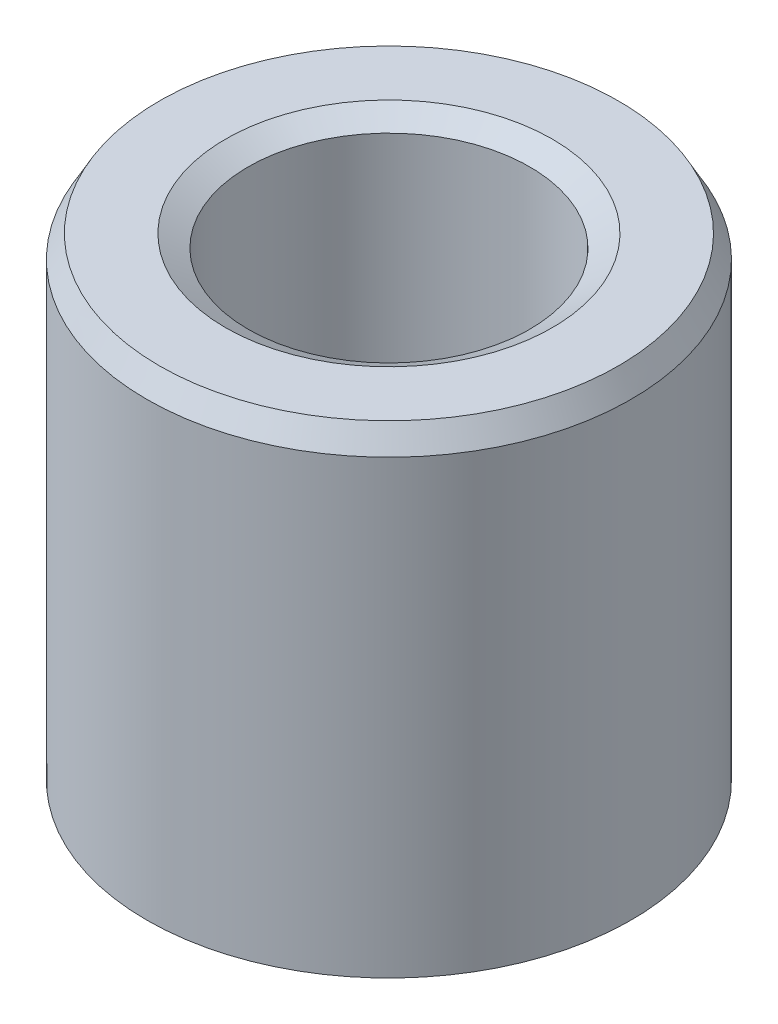
ISO-10303-21;
HEADER;
FILE_DESCRIPTION(('STEP AP214'),'2;1');
FILE_NAME('part.step','',(''),(''),'','','');
FILE_SCHEMA(('AUTOMOTIVE_DESIGN { 1 0 10303 214 1 1 1 1 }'));
ENDSEC;
DATA;
#1=APPLICATION_CONTEXT('core data for automotive mechanical design processes');
#2=APPLICATION_PROTOCOL_DEFINITION('international standard','automotive_design',2000,#1);
#3=PRODUCT_CONTEXT('',#1,'mechanical');
#4=PRODUCT('Part','Part','',(#3));
#5=PRODUCT_RELATED_PRODUCT_CATEGORY('part','',(#4));
#6=PRODUCT_DEFINITION_FORMATION('','',#4);
#7=PRODUCT_DEFINITION_CONTEXT('part definition',#1,'design');
#8=PRODUCT_DEFINITION('design','',#6,#7);
#9=PRODUCT_DEFINITION_SHAPE('','',#8);
#10=(LENGTH_UNIT() NAMED_UNIT(*) SI_UNIT(.MILLI.,.METRE.));
#11=(NAMED_UNIT(*) PLANE_ANGLE_UNIT() SI_UNIT($,.RADIAN.));
#12=(NAMED_UNIT(*) SI_UNIT($,.STERADIAN.) SOLID_ANGLE_UNIT());
#13=UNCERTAINTY_MEASURE_WITH_UNIT(LENGTH_MEASURE(1.E-05),#10,'distance_accuracy_value','');
#14=(GEOMETRIC_REPRESENTATION_CONTEXT(3) GLOBAL_UNCERTAINTY_ASSIGNED_CONTEXT((#13)) GLOBAL_UNIT_ASSIGNED_CONTEXT((#10,
#11,#12)) REPRESENTATION_CONTEXT('',''));
#15=CARTESIAN_POINT('',(0.,0.,0.));
#16=DIRECTION('',(0.,0.,1.));
#17=DIRECTION('',(1.,0.,0.));
#18=AXIS2_PLACEMENT_3D('',#15,#16,#17);
#19=CARTESIAN_POINT('',(0.,60.2380015320802,0.));
#20=DIRECTION('',(0.,-1.,0.));
#21=DIRECTION('',(0.,0.,-1.));
#22=AXIS2_PLACEMENT_3D('',#19,#20,#21);
#23=CYLINDRICAL_SURFACE('',#22,30.);
#24=CARTESIAN_POINT('',(0.,1.57377322664465,0.));
#25=DIRECTION('',(0.,1.,0.));
#26=DIRECTION('',(0.,0.,1.));
#27=AXIS2_PLACEMENT_3D('',#24,#25,#26);
#28=CIRCLE('',#27,30.);
#29=CARTESIAN_POINT('',(0.,1.57377322664465,30.));
#30=VERTEX_POINT('',#29);
#31=EDGE_CURVE('E10',#30,#30,#28,.T.);
#32=ORIENTED_EDGE('',*,*,#31,.T.);
#33=EDGE_LOOP('',(#32));
#34=FACE_BOUND('',#33,.T.);
#35=CARTESIAN_POINT('',(0.,57.4370183520787,0.));
#36=DIRECTION('',(0.,1.,0.));
#37=DIRECTION('',(0.,0.,1.));
#38=AXIS2_PLACEMENT_3D('',#35,#36,#37);
#39=CIRCLE('',#38,30.);
#40=CARTESIAN_POINT('',(0.,57.4370183520787,30.));
#41=VERTEX_POINT('',#40);
#42=EDGE_CURVE('E50',#41,#41,#39,.F.);
#43=ORIENTED_EDGE('',*,*,#42,.T.);
#44=EDGE_LOOP('',(#43));
#45=FACE_BOUND('',#44,.T.);
#46=ADVANCED_FACE('F39',(#34,#45),#23,.T.);
#47=CARTESIAN_POINT('',(0.,60.2380015320802,0.));
#48=DIRECTION('',(0.,1.,0.));
#49=DIRECTION('',(0.,0.,1.));
#50=AXIS2_PLACEMENT_3D('',#47,#48,#49);
#51=PLANE('',#50);
#52=CARTESIAN_POINT('',(0.,60.2380015320802,0.));
#53=DIRECTION('',(0.,1.,0.));
#54=DIRECTION('',(0.,0.,1.));
#55=AXIS2_PLACEMENT_3D('',#52,#53,#54);
#56=CIRCLE('',#55,20.2364594840862);
#57=CARTESIAN_POINT('',(0.,60.2380015320802,20.2364594840862));
#58=VERTEX_POINT('',#57);
#59=EDGE_CURVE('E58',#58,#58,#56,.F.);
#60=ORIENTED_EDGE('',*,*,#59,.T.);
#61=EDGE_LOOP('',(#60));
#62=FACE_BOUND('',#61,.T.);
#63=CARTESIAN_POINT('',(0.,60.2380015320802,0.));
#64=DIRECTION('',(0.,1.,0.));
#65=DIRECTION('',(0.,0.,1.));
#66=AXIS2_PLACEMENT_3D('',#63,#64,#65);
#67=CIRCLE('',#66,28.4262267733553);
#68=CARTESIAN_POINT('',(0.,60.2380015320802,28.4262267733553));
#69=VERTEX_POINT('',#68);
#70=EDGE_CURVE('E61',#69,#69,#67,.T.);
#71=ORIENTED_EDGE('',*,*,#70,.T.);
#72=EDGE_LOOP('',(#71));
#73=FACE_BOUND('',#72,.T.);
#74=ADVANCED_FACE('F88',(#62,#73),#51,.T.);
#75=CARTESIAN_POINT('',(0.,0.,0.));
#76=DIRECTION('',(0.,1.,0.));
#77=DIRECTION('',(0.,0.,1.));
#78=AXIS2_PLACEMENT_3D('',#75,#76,#77);
#79=PLANE('',#78);
#80=CARTESIAN_POINT('',(0.,0.,0.));
#81=DIRECTION('',(0.,1.,0.));
#82=DIRECTION('',(0.,0.,1.));
#83=AXIS2_PLACEMENT_3D('',#80,#81,#82);
#84=CIRCLE('',#83,19.0092495307294);
#85=CARTESIAN_POINT('',(0.,0.,19.0092495307294));
#86=VERTEX_POINT('',#85);
#87=EDGE_CURVE('E51',#86,#86,#84,.T.);
#88=ORIENTED_EDGE('',*,*,#87,.T.);
#89=EDGE_LOOP('',(#88));
#90=FACE_BOUND('',#89,.T.);
#91=CARTESIAN_POINT('',(0.,0.,0.));
#92=DIRECTION('',(0.,1.,0.));
#93=DIRECTION('',(0.,0.,1.));
#94=AXIS2_PLACEMENT_3D('',#91,#92,#93);
#95=CIRCLE('',#94,27.1990168199985);
#96=CARTESIAN_POINT('',(0.,0.,27.1990168199985));
#97=VERTEX_POINT('',#96);
#98=EDGE_CURVE('E54',#97,#97,#95,.F.);
#99=ORIENTED_EDGE('',*,*,#98,.T.);
#100=EDGE_LOOP('',(#99));
#101=FACE_BOUND('',#100,.T.);
#102=ADVANCED_FACE('F83',(#90,#101),#79,.F.);
#103=CARTESIAN_POINT('',(0.,60.2380015320802,0.));
#104=DIRECTION('',(0.,-1.,0.));
#105=DIRECTION('',(0.,0.,-1.));
#106=AXIS2_PLACEMENT_3D('',#103,#104,#105);
#107=CYLINDRICAL_SURFACE('',#106,17.4354763040847);
#108=CARTESIAN_POINT('',(0.,58.6642283054355,0.));
#109=DIRECTION('',(0.,1.,0.));
#110=DIRECTION('',(0.,0.,1.));
#111=AXIS2_PLACEMENT_3D('',#108,#109,#110);
#112=CIRCLE('',#111,17.4354763040847);
#113=CARTESIAN_POINT('',(0.,58.6642283054355,17.4354763040847));
#114=VERTEX_POINT('',#113);
#115=EDGE_CURVE('E67',#114,#114,#112,.T.);
#116=ORIENTED_EDGE('',*,*,#115,.T.);
#117=EDGE_LOOP('',(#116));
#118=FACE_BOUND('',#117,.T.);
#119=CARTESIAN_POINT('',(0.,2.80098318000147,0.));
#120=DIRECTION('',(0.,1.,0.));
#121=DIRECTION('',(0.,0.,1.));
#122=AXIS2_PLACEMENT_3D('',#119,#120,#121);
#123=CIRCLE('',#122,17.4354763040847);
#124=CARTESIAN_POINT('',(0.,2.80098318000147,17.4354763040847));
#125=VERTEX_POINT('',#124);
#126=EDGE_CURVE('E69',#125,#125,#123,.F.);
#127=ORIENTED_EDGE('',*,*,#126,.T.);
#128=EDGE_LOOP('',(#127));
#129=FACE_BOUND('',#128,.T.);
#130=ADVANCED_FACE('F71',(#118,#129),#107,.F.);
#131=CARTESIAN_POINT('',(0.,58.6642283054355,0.));
#132=DIRECTION('',(0.,1.,0.));
#133=DIRECTION('',(0.,0.,1.));
#134=AXIS2_PLACEMENT_3D('',#131,#132,#133);
#135=CONICAL_SURFACE('',#134,17.4354763040847,1.05888969356454);
#136=ORIENTED_EDGE('',*,*,#59,.F.);
#137=EDGE_LOOP('',(#136));
#138=FACE_BOUND('',#137,.T.);
#139=ORIENTED_EDGE('',*,*,#115,.F.);
#140=EDGE_LOOP('',(#139));
#141=FACE_BOUND('',#140,.T.);
#142=ADVANCED_FACE('F77',(#138,#141),#135,.F.);
#143=CARTESIAN_POINT('',(0.,0.,0.));
#144=DIRECTION('',(0.,-1.,0.));
#145=DIRECTION('',(0.,0.,-1.));
#146=AXIS2_PLACEMENT_3D('',#143,#144,#145);
#147=CONICAL_SURFACE('',#146,19.0092495307294,0.511906633230354);
#148=ORIENTED_EDGE('',*,*,#126,.F.);
#149=EDGE_LOOP('',(#148));
#150=FACE_BOUND('',#149,.T.);
#151=ORIENTED_EDGE('',*,*,#87,.F.);
#152=EDGE_LOOP('',(#151));
#153=FACE_BOUND('',#152,.T.);
#154=ADVANCED_FACE('F73',(#150,#153),#147,.F.);
#155=CARTESIAN_POINT('',(0.,1.57377322664465,0.));
#156=DIRECTION('',(0.,1.,0.));
#157=DIRECTION('',(0.,0.,1.));
#158=AXIS2_PLACEMENT_3D('',#155,#156,#157);
#159=CONICAL_SURFACE('',#158,30.,1.05888969356454);
#160=CARTESIAN_POINT('',(0.,0.,27.1990168199985));
#161=CARTESIAN_POINT('',(0.,0.0163934711108812,27.2281937281235));
#162=CARTESIAN_POINT('',(0.,0.0327869422217631,27.2573706362486));
#163=CARTESIAN_POINT('',(0.,0.065573884443527,27.3157244524986));
#164=CARTESIAN_POINT('',(0.,0.0819673555544089,27.3449013606236));
#165=CARTESIAN_POINT('',(0.,0.114754297776172,27.4032551768736));
#166=CARTESIAN_POINT('',(0.,0.131147768887054,27.4324320849987));
#167=CARTESIAN_POINT('',(0.,0.163934711108817,27.4907859012487));
#168=CARTESIAN_POINT('',(0.,0.180328182219699,27.5199628093737));
#169=CARTESIAN_POINT('',(0.,0.213115124441463,27.5783166256237));
#170=CARTESIAN_POINT('',(0.,0.229508595552344,27.6074935337487));
#171=CARTESIAN_POINT('',(0.,0.262295537774108,27.6658473499988));
#172=CARTESIAN_POINT('',(0.,0.27868900888499,27.6950242581238));
#173=CARTESIAN_POINT('',(0.,0.311475951106753,27.7533780743738));
#174=CARTESIAN_POINT('',(0.,0.327869422217635,27.7825549824988));
#175=CARTESIAN_POINT('',(0.,0.360656364439398,27.8409087987489));
#176=CARTESIAN_POINT('',(0.,0.37704983555028,27.8700857068739));
#177=CARTESIAN_POINT('',(0.,0.409836777772044,27.9284395231239));
#178=CARTESIAN_POINT('',(0.,0.426230248882926,27.9576164312489));
#179=CARTESIAN_POINT('',(0.,0.459017191104689,28.015970247499));
#180=CARTESIAN_POINT('',(0.,0.47541066221557,28.045147155624));
#181=CARTESIAN_POINT('',(0.,0.508197604437334,28.103500971874));
#182=CARTESIAN_POINT('',(0.,0.524591075548216,28.132677879999));
#183=CARTESIAN_POINT('',(0.,0.55737801776998,28.191031696249));
#184=CARTESIAN_POINT('',(0.,0.573771488880861,28.2202086043741));
#185=CARTESIAN_POINT('',(0.,0.606558431102625,28.2785624206241));
#186=CARTESIAN_POINT('',(0.,0.622951902213506,28.3077393287491));
#187=CARTESIAN_POINT('',(0.,0.65573884443527,28.3660931449991));
#188=CARTESIAN_POINT('',(0.,0.672132315546151,28.3952700531242));
#189=CARTESIAN_POINT('',(0.,0.704919257767915,28.4536238693742));
#190=CARTESIAN_POINT('',(0.,0.721312728878797,28.4828007774992));
#191=CARTESIAN_POINT('',(0.,0.75409967110056,28.5411545937492));
#192=CARTESIAN_POINT('',(0.,0.770493142211442,28.5703315018742));
#193=CARTESIAN_POINT('',(0.,0.803280084433206,28.6286853181243));
#194=CARTESIAN_POINT('',(0.,0.819673555544087,28.6578622262493));
#195=CARTESIAN_POINT('',(0.,0.852460497765851,28.7162160424993));
#196=CARTESIAN_POINT('',(0.,0.868853968876732,28.7453929506243));
#197=CARTESIAN_POINT('',(0.,0.901640911098496,28.8037467668744));
#198=CARTESIAN_POINT('',(0.,0.918034382209378,28.8329236749994));
#199=CARTESIAN_POINT('',(0.,0.950821324431141,28.8912774912494));
#200=CARTESIAN_POINT('',(0.,0.967214795542023,28.9204543993744));
#201=CARTESIAN_POINT('',(0.,1.00000173776379,28.9788082156245));
#202=CARTESIAN_POINT('',(0.,1.01639520887467,29.0079851237495));
#203=CARTESIAN_POINT('',(0.,1.04918215109643,29.0663389399995));
#204=CARTESIAN_POINT('',(0.,1.06557562220731,29.0955158481245));
#205=CARTESIAN_POINT('',(0.,1.09836256442908,29.1538696643746));
#206=CARTESIAN_POINT('',(0.,1.11475603553996,29.1830465724996));
#207=CARTESIAN_POINT('',(0.,1.14754297776172,29.2414003887496));
#208=CARTESIAN_POINT('',(0.,1.1639364488726,29.2705772968746));
#209=CARTESIAN_POINT('',(0.,1.19672339109437,29.3289311131246));
#210=CARTESIAN_POINT('',(0.,1.21311686220525,29.3581080212497));
#211=CARTESIAN_POINT('',(0.,1.24590380442701,29.4164618374997));
#212=CARTESIAN_POINT('',(0.,1.26229727553789,29.4456387456247));
#213=CARTESIAN_POINT('',(0.,1.29508421775966,29.5039925618747));
#214=CARTESIAN_POINT('',(0.,1.31147768887054,29.5331694699998));
#215=CARTESIAN_POINT('',(0.,1.3442646310923,29.5915232862498));
#216=CARTESIAN_POINT('',(0.,1.36065810220318,29.6207001943748));
#217=CARTESIAN_POINT('',(0.,1.39344504442495,29.6790540106248));
#218=CARTESIAN_POINT('',(0.,1.40983851553583,29.7082309187498));
#219=CARTESIAN_POINT('',(0.,1.44262545775759,29.7665847349999));
#220=CARTESIAN_POINT('',(0.,1.45901892886848,29.7957616431249));
#221=CARTESIAN_POINT('',(0.,1.49180587109024,29.8541154593749));
#222=CARTESIAN_POINT('',(0.,1.50819934220112,29.8832923674999));
#223=CARTESIAN_POINT('',(0.,1.54098628442288,29.94164618375));
#224=CARTESIAN_POINT('',(0.,1.55737975553377,29.970823091875));
#225=CARTESIAN_POINT('',(0.,1.57377322664465,30.));
#226=B_SPLINE_CURVE_WITH_KNOTS('',3,(#160,#161,#162,#163,#164,#165,#166,#167,#168,#169,#170,
#171,#172,#173,#174,#175,#176,#177,#178,#179,#180,#181,#182,#183,#184,#185,#186,#187,#188,#189,
#190,#191,#192,#193,#194,#195,#196,#197,#198,#199,#200,#201,#202,#203,#204,#205,#206,#207,#208,
#209,#210,#211,#212,#213,#214,#215,#216,#217,#218,#219,#220,#221,#222,#223,#224,#225),
.UNSPECIFIED.,.F.,.F.,(4,2,2,2,2,2,2,2,2,2,2,2,2,2,2,2,2,2,2,2,2,2,2,2,2,2,2,2,2,2,2,2,4),(0.,
0.100400900221014,0.200801800442027,0.301202700663044,0.401603600884057,0.502004501105071,
0.602405401326084,0.702806301547101,0.803207201768114,0.903608101989128,1.00400900221014,
1.10440990243116,1.20481080265217,1.30521170287319,1.4056126030942,1.50601350331521,
1.60641440353623,1.70681530375724,1.80721620397826,1.90761710419927,2.00801800442029,
2.1084189046413,2.20881980486232,2.30922070508333,2.40962160530435,2.51002250552536,
2.61042340574637,2.71082430596739,2.8112252061884,2.91162610640942,3.01202700663043,
3.11242790685145,3.21282880707246),.UNSPECIFIED.);
#227=EDGE_CURVE('BSEAM76',#97,#30,#226,.T.);
#228=ORIENTED_EDGE('',*,*,#98,.F.);
#229=ORIENTED_EDGE('',*,*,#31,.F.);
#230=ORIENTED_EDGE('',*,*,#227,.T.);
#231=ORIENTED_EDGE('',*,*,#227,.F.);
#232=EDGE_LOOP('',(#228,#230,#229,#231));
#233=FACE_BOUND('',#232,.T.);
#234=ADVANCED_FACE('F76',(#233),#159,.T.);
#235=CARTESIAN_POINT('',(0.,60.2380015320802,0.));
#236=DIRECTION('',(0.,-1.,0.));
#237=DIRECTION('',(0.,0.,-1.));
#238=AXIS2_PLACEMENT_3D('',#235,#236,#237);
#239=CONICAL_SURFACE('',#238,28.4262267733553,0.511906633230353);
#240=ORIENTED_EDGE('',*,*,#42,.F.);
#241=EDGE_LOOP('',(#240));
#242=FACE_BOUND('',#241,.T.);
#243=ORIENTED_EDGE('',*,*,#70,.F.);
#244=EDGE_LOOP('',(#243));
#245=FACE_BOUND('',#244,.T.);
#246=ADVANCED_FACE('F45',(#242,#245),#239,.T.);
#247=CLOSED_SHELL('',(#46,#74,#102,#130,#142,#154,#234,#246));
#248=MANIFOLD_SOLID_BREP('B2',#247);
#249=ADVANCED_BREP_SHAPE_REPRESENTATION('',(#18,#248),#14);
#250=SHAPE_DEFINITION_REPRESENTATION(#9,#249);
ENDSEC;
END-ISO-10303-21;
